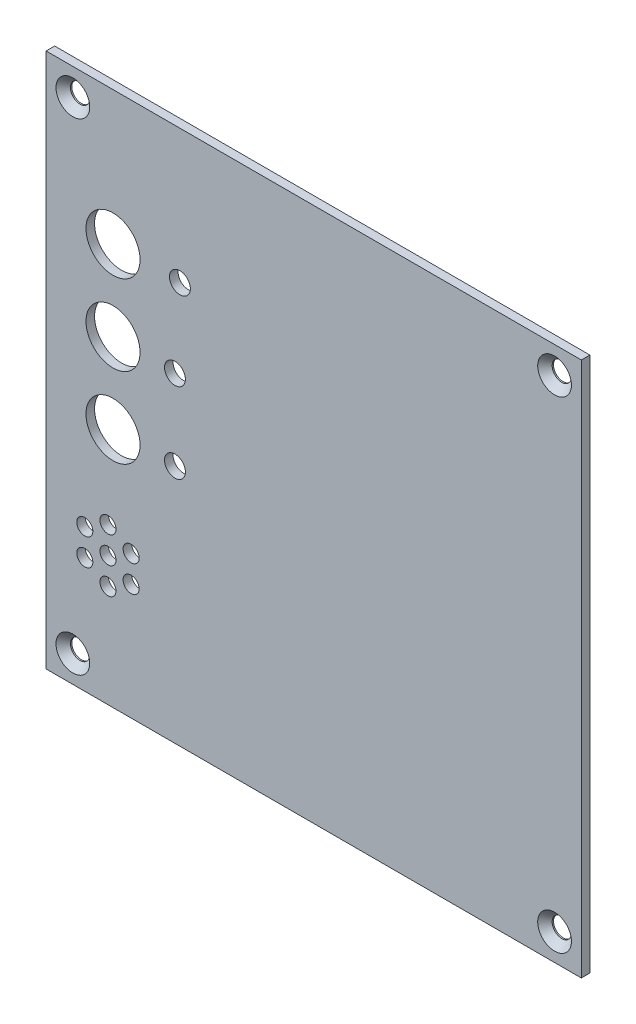
ISO-10303-21;
HEADER;
FILE_DESCRIPTION(('STEP AP214'),'2;1');
FILE_NAME('part.step','',(''),(''),'','','');
FILE_SCHEMA(('AUTOMOTIVE_DESIGN { 1 0 10303 214 1 1 1 1 }'));
ENDSEC;
DATA;
#1=APPLICATION_CONTEXT('core data for automotive mechanical design processes');
#2=APPLICATION_PROTOCOL_DEFINITION('international standard','automotive_design',2000,#1);
#3=PRODUCT_CONTEXT('',#1,'mechanical');
#4=PRODUCT('Part','Part','',(#3));
#5=PRODUCT_RELATED_PRODUCT_CATEGORY('part','',(#4));
#6=PRODUCT_DEFINITION_FORMATION('','',#4);
#7=PRODUCT_DEFINITION_CONTEXT('part definition',#1,'design');
#8=PRODUCT_DEFINITION('design','',#6,#7);
#9=PRODUCT_DEFINITION_SHAPE('','',#8);
#10=(LENGTH_UNIT() NAMED_UNIT(*) SI_UNIT(.MILLI.,.METRE.));
#11=(NAMED_UNIT(*) PLANE_ANGLE_UNIT() SI_UNIT($,.RADIAN.));
#12=(NAMED_UNIT(*) SI_UNIT($,.STERADIAN.) SOLID_ANGLE_UNIT());
#13=UNCERTAINTY_MEASURE_WITH_UNIT(LENGTH_MEASURE(1.E-05),#10,'distance_accuracy_value','');
#14=(GEOMETRIC_REPRESENTATION_CONTEXT(3) GLOBAL_UNCERTAINTY_ASSIGNED_CONTEXT((#13)) GLOBAL_UNIT_ASSIGNED_CONTEXT((#10,
#11,#12)) REPRESENTATION_CONTEXT('',''));
#15=CARTESIAN_POINT('',(0.,0.,0.));
#16=DIRECTION('',(0.,0.,1.));
#17=DIRECTION('',(1.,0.,0.));
#18=AXIS2_PLACEMENT_3D('',#15,#16,#17);
#19=CARTESIAN_POINT('',(0.,0.,0.));
#20=DIRECTION('',(0.,0.,-1.));
#21=DIRECTION('',(-1.,0.,0.));
#22=AXIS2_PLACEMENT_3D('',#19,#20,#21);
#23=PLANE('',#22);
#24=CARTESIAN_POINT('',(7.22687298107787,21.63,0.));
#25=DIRECTION('',(0.,0.,1.));
#26=DIRECTION('',(1.,0.,0.));
#27=AXIS2_PLACEMENT_3D('',#24,#25,#26);
#28=CIRCLE('',#27,1.5);
#29=CARTESIAN_POINT('',(8.72687298107787,21.63,0.));
#30=VERTEX_POINT('',#29);
#31=EDGE_CURVE('E181',#30,#30,#28,.T.);
#32=ORIENTED_EDGE('',*,*,#31,.T.);
#33=EDGE_LOOP('',(#32));
#34=FACE_BOUND('',#33,.T.);
#35=CARTESIAN_POINT('',(11.5570000000001,19.13,0.));
#36=DIRECTION('',(0.,0.,1.));
#37=DIRECTION('',(1.,0.,0.));
#38=AXIS2_PLACEMENT_3D('',#35,#36,#37);
#39=CIRCLE('',#38,1.5);
#40=CARTESIAN_POINT('',(13.0570000000001,19.13,0.));
#41=VERTEX_POINT('',#40);
#42=EDGE_CURVE('E188',#41,#41,#39,.T.);
#43=ORIENTED_EDGE('',*,*,#42,.T.);
#44=EDGE_LOOP('',(#43));
#45=FACE_BOUND('',#44,.T.);
#46=CARTESIAN_POINT('',(15.8871270189223,21.63,0.));
#47=DIRECTION('',(0.,0.,1.));
#48=DIRECTION('',(1.,0.,0.));
#49=AXIS2_PLACEMENT_3D('',#46,#47,#48);
#50=CIRCLE('',#49,1.5);
#51=CARTESIAN_POINT('',(17.3871270189223,21.63,0.));
#52=VERTEX_POINT('',#51);
#53=EDGE_CURVE('E194',#52,#52,#50,.T.);
#54=ORIENTED_EDGE('',*,*,#53,.T.);
#55=EDGE_LOOP('',(#54));
#56=FACE_BOUND('',#55,.T.);
#57=CARTESIAN_POINT('',(15.8871270189222,26.63,0.));
#58=DIRECTION('',(0.,0.,1.));
#59=DIRECTION('',(1.,0.,0.));
#60=AXIS2_PLACEMENT_3D('',#57,#58,#59);
#61=CIRCLE('',#60,1.5);
#62=CARTESIAN_POINT('',(17.3871270189222,26.63,0.));
#63=VERTEX_POINT('',#62);
#64=EDGE_CURVE('E170',#63,#63,#61,.T.);
#65=ORIENTED_EDGE('',*,*,#64,.T.);
#66=EDGE_LOOP('',(#65));
#67=FACE_BOUND('',#66,.T.);
#68=CARTESIAN_POINT('',(25.,75.,0.));
#69=DIRECTION('',(0.,0.,1.));
#70=DIRECTION('',(1.,0.,0.));
#71=AXIS2_PLACEMENT_3D('',#68,#69,#70);
#72=CIRCLE('',#71,1.94999999999999);
#73=CARTESIAN_POINT('',(26.95,75.,0.));
#74=VERTEX_POINT('',#73);
#75=EDGE_CURVE('E151',#74,#74,#72,.T.);
#76=ORIENTED_EDGE('',*,*,#75,.T.);
#77=EDGE_LOOP('',(#76));
#78=FACE_BOUND('',#77,.T.);
#79=CARTESIAN_POINT('',(11.557,24.13,0.));
#80=DIRECTION('',(0.,0.,1.));
#81=DIRECTION('',(1.,0.,0.));
#82=AXIS2_PLACEMENT_3D('',#79,#80,#81);
#83=CIRCLE('',#82,1.5);
#84=CARTESIAN_POINT('',(13.057,24.13,0.));
#85=VERTEX_POINT('',#84);
#86=EDGE_CURVE('E157',#85,#85,#83,.T.);
#87=ORIENTED_EDGE('',*,*,#86,.T.);
#88=EDGE_LOOP('',(#87));
#89=FACE_BOUND('',#88,.T.);
#90=CARTESIAN_POINT('',(12.5000000000002,60.,0.));
#91=DIRECTION('',(0.,0.,1.));
#92=DIRECTION('',(1.,0.,0.));
#93=AXIS2_PLACEMENT_3D('',#90,#91,#92);
#94=CIRCLE('',#93,5.05);
#95=CARTESIAN_POINT('',(17.5500000000002,60.,0.));
#96=VERTEX_POINT('',#95);
#97=EDGE_CURVE('E158',#96,#96,#94,.T.);
#98=ORIENTED_EDGE('',*,*,#97,.T.);
#99=EDGE_LOOP('',(#98));
#100=FACE_BOUND('',#99,.T.);
#101=CARTESIAN_POINT('',(11.557,29.13,0.));
#102=DIRECTION('',(0.,0.,1.));
#103=DIRECTION('',(1.,0.,0.));
#104=AXIS2_PLACEMENT_3D('',#101,#102,#103);
#105=CIRCLE('',#104,1.5);
#106=CARTESIAN_POINT('',(13.057,29.13,0.));
#107=VERTEX_POINT('',#106);
#108=EDGE_CURVE('E169',#107,#107,#105,.T.);
#109=ORIENTED_EDGE('',*,*,#108,.T.);
#110=EDGE_LOOP('',(#109));
#111=FACE_BOUND('',#110,.T.);
#112=CARTESIAN_POINT('',(7.22687298107785,26.63,0.));
#113=DIRECTION('',(0.,0.,1.));
#114=DIRECTION('',(1.,0.,0.));
#115=AXIS2_PLACEMENT_3D('',#112,#113,#114);
#116=CIRCLE('',#115,1.5);
#117=CARTESIAN_POINT('',(8.72687298107786,26.63,0.));
#118=VERTEX_POINT('',#117);
#119=EDGE_CURVE('E182',#118,#118,#116,.T.);
#120=ORIENTED_EDGE('',*,*,#119,.T.);
#121=EDGE_LOOP('',(#120));
#122=FACE_BOUND('',#121,.T.);
#123=CARTESIAN_POINT('',(12.5000000000003,45.,0.));
#124=DIRECTION('',(0.,0.,1.));
#125=DIRECTION('',(1.,0.,0.));
#126=AXIS2_PLACEMENT_3D('',#123,#124,#125);
#127=CIRCLE('',#126,5.05);
#128=CARTESIAN_POINT('',(17.5500000000003,45.,0.));
#129=VERTEX_POINT('',#128);
#130=EDGE_CURVE('E217',#129,#129,#127,.T.);
#131=ORIENTED_EDGE('',*,*,#130,.T.);
#132=EDGE_LOOP('',(#131));
#133=FACE_BOUND('',#132,.T.);
#134=CARTESIAN_POINT('',(24.0718017395184,59.8692460141133,0.));
#135=DIRECTION('',(0.,0.,1.));
#136=DIRECTION('',(1.,0.,0.));
#137=AXIS2_PLACEMENT_3D('',#134,#135,#136);
#138=CIRCLE('',#137,1.95);
#139=CARTESIAN_POINT('',(26.0218017395184,59.8692460141133,0.));
#140=VERTEX_POINT('',#139);
#141=EDGE_CURVE('E211',#140,#140,#138,.T.);
#142=ORIENTED_EDGE('',*,*,#141,.T.);
#143=EDGE_LOOP('',(#142));
#144=FACE_BOUND('',#143,.T.);
#145=CARTESIAN_POINT('',(24.0718017395186,44.8692460141133,0.));
#146=DIRECTION('',(0.,0.,1.));
#147=DIRECTION('',(1.,0.,0.));
#148=AXIS2_PLACEMENT_3D('',#145,#146,#147);
#149=CIRCLE('',#148,1.95);
#150=CARTESIAN_POINT('',(26.0218017395186,44.8692460141133,0.));
#151=VERTEX_POINT('',#150);
#152=EDGE_CURVE('E205',#151,#151,#149,.T.);
#153=ORIENTED_EDGE('',*,*,#152,.T.);
#154=EDGE_LOOP('',(#153));
#155=FACE_BOUND('',#154,.T.);
#156=CARTESIAN_POINT('',(12.5,75.,0.));
#157=DIRECTION('',(0.,0.,1.));
#158=DIRECTION('',(1.,0.,0.));
#159=AXIS2_PLACEMENT_3D('',#156,#157,#158);
#160=CIRCLE('',#159,5.05);
#161=CARTESIAN_POINT('',(17.55,75.,0.));
#162=VERTEX_POINT('',#161);
#163=EDGE_CURVE('E147',#162,#162,#160,.T.);
#164=ORIENTED_EDGE('',*,*,#163,.T.);
#165=EDGE_LOOP('',(#164));
#166=FACE_BOUND('',#165,.T.);
#167=CARTESIAN_POINT('',(4.99999999999999,95.,0.));
#168=DIRECTION('',(0.,0.,1.));
#169=DIRECTION('',(1.,0.,0.));
#170=AXIS2_PLACEMENT_3D('',#167,#168,#169);
#171=CIRCLE('',#170,1.8);
#172=CARTESIAN_POINT('',(6.79999999999999,95.,0.));
#173=VERTEX_POINT('',#172);
#174=EDGE_CURVE('E138',#173,#173,#171,.T.);
#175=ORIENTED_EDGE('',*,*,#174,.T.);
#176=EDGE_LOOP('',(#175));
#177=FACE_BOUND('',#176,.T.);
#178=CARTESIAN_POINT('',(95.,95.,0.));
#179=DIRECTION('',(0.,0.,1.));
#180=DIRECTION('',(1.,0.,0.));
#181=AXIS2_PLACEMENT_3D('',#178,#179,#180);
#182=CIRCLE('',#181,1.8);
#183=CARTESIAN_POINT('',(96.8,95.,0.));
#184=VERTEX_POINT('',#183);
#185=EDGE_CURVE('E129',#184,#184,#182,.T.);
#186=ORIENTED_EDGE('',*,*,#185,.T.);
#187=EDGE_LOOP('',(#186));
#188=FACE_BOUND('',#187,.T.);
#189=DIRECTION('',(0.,-1.,0.));
#190=VECTOR('',#189,1.);
#191=CARTESIAN_POINT('',(0.,0.,0.));
#192=LINE('',#191,#190);
#193=CARTESIAN_POINT('',(0.,100.,0.));
#194=VERTEX_POINT('',#193);
#195=CARTESIAN_POINT('',(0.,0.,0.));
#196=VERTEX_POINT('',#195);
#197=EDGE_CURVE('E98',#194,#196,#192,.T.);
#198=ORIENTED_EDGE('',*,*,#197,.F.);
#199=DIRECTION('',(-1.,0.,0.));
#200=VECTOR('',#199,1.);
#201=CARTESIAN_POINT('',(0.,100.,0.));
#202=LINE('',#201,#200);
#203=CARTESIAN_POINT('',(100.,100.,0.));
#204=VERTEX_POINT('',#203);
#205=EDGE_CURVE('E74',#204,#194,#202,.T.);
#206=ORIENTED_EDGE('',*,*,#205,.F.);
#207=DIRECTION('',(0.,1.,0.));
#208=VECTOR('',#207,1.);
#209=CARTESIAN_POINT('',(100.,0.,0.));
#210=LINE('',#209,#208);
#211=CARTESIAN_POINT('',(100.,0.,0.));
#212=VERTEX_POINT('',#211);
#213=EDGE_CURVE('E68',#212,#204,#210,.T.);
#214=ORIENTED_EDGE('',*,*,#213,.F.);
#215=DIRECTION('',(1.,0.,0.));
#216=VECTOR('',#215,1.);
#217=CARTESIAN_POINT('',(0.,0.,0.));
#218=LINE('',#217,#216);
#219=EDGE_CURVE('E90',#196,#212,#218,.T.);
#220=ORIENTED_EDGE('',*,*,#219,.F.);
#221=EDGE_LOOP('',(#198,#206,#214,#220));
#222=FACE_BOUND('',#221,.T.);
#223=CARTESIAN_POINT('',(4.99999999999999,5.,0.));
#224=DIRECTION('',(0.,0.,1.));
#225=DIRECTION('',(1.,0.,0.));
#226=AXIS2_PLACEMENT_3D('',#223,#224,#225);
#227=CIRCLE('',#226,1.8);
#228=CARTESIAN_POINT('',(6.79999999999999,5.,0.));
#229=VERTEX_POINT('',#228);
#230=EDGE_CURVE('E101',#229,#229,#227,.T.);
#231=ORIENTED_EDGE('',*,*,#230,.T.);
#232=EDGE_LOOP('',(#231));
#233=FACE_BOUND('',#232,.T.);
#234=CARTESIAN_POINT('',(95.,5.,0.));
#235=DIRECTION('',(0.,0.,1.));
#236=DIRECTION('',(1.,0.,0.));
#237=AXIS2_PLACEMENT_3D('',#234,#235,#236);
#238=CIRCLE('',#237,1.8);
#239=CARTESIAN_POINT('',(96.8,5.,0.));
#240=VERTEX_POINT('',#239);
#241=EDGE_CURVE('E120',#240,#240,#238,.T.);
#242=ORIENTED_EDGE('',*,*,#241,.T.);
#243=EDGE_LOOP('',(#242));
#244=FACE_BOUND('',#243,.T.);
#245=ADVANCED_FACE('F34',(#34,#45,#56,#67,#78,#89,#100,#111,#122,#133,#144,#155,#166,#177,#188,
#222,#233,#244),#23,.T.);
#246=CARTESIAN_POINT('',(0.,0.,1.6));
#247=DIRECTION('',(1.,0.,0.));
#248=DIRECTION('',(0.,1.,0.));
#249=AXIS2_PLACEMENT_3D('',#246,#247,#248);
#250=PLANE('',#249);
#251=ORIENTED_EDGE('',*,*,#197,.T.);
#252=DIRECTION('',(0.,0.,-1.));
#253=VECTOR('',#252,1.);
#254=CARTESIAN_POINT('',(0.,0.,1.6));
#255=LINE('',#254,#253);
#256=CARTESIAN_POINT('',(0.,0.,1.6));
#257=VERTEX_POINT('',#256);
#258=EDGE_CURVE('E11',#257,#196,#255,.T.);
#259=ORIENTED_EDGE('',*,*,#258,.F.);
#260=DIRECTION('',(0.,-1.,0.));
#261=VECTOR('',#260,1.);
#262=CARTESIAN_POINT('',(0.,0.,1.6));
#263=LINE('',#262,#261);
#264=CARTESIAN_POINT('',(0.,100.,1.6));
#265=VERTEX_POINT('',#264);
#266=EDGE_CURVE('E86',#265,#257,#263,.T.);
#267=ORIENTED_EDGE('',*,*,#266,.F.);
#268=DIRECTION('',(0.,0.,-1.));
#269=VECTOR('',#268,1.);
#270=CARTESIAN_POINT('',(0.,100.,1.6));
#271=LINE('',#270,#269);
#272=EDGE_CURVE('E94',#265,#194,#271,.T.);
#273=ORIENTED_EDGE('',*,*,#272,.T.);
#274=EDGE_LOOP('',(#251,#259,#267,#273));
#275=FACE_BOUND('',#274,.T.);
#276=ADVANCED_FACE('F36',(#275),#250,.F.);
#277=CARTESIAN_POINT('',(0.,0.,1.6));
#278=DIRECTION('',(0.,1.,0.));
#279=DIRECTION('',(0.,0.,1.));
#280=AXIS2_PLACEMENT_3D('',#277,#278,#279);
#281=PLANE('',#280);
#282=ORIENTED_EDGE('',*,*,#219,.T.);
#283=DIRECTION('',(0.,0.,-1.));
#284=VECTOR('',#283,1.);
#285=CARTESIAN_POINT('',(100.,0.,1.6));
#286=LINE('',#285,#284);
#287=CARTESIAN_POINT('',(100.,0.,1.6));
#288=VERTEX_POINT('',#287);
#289=EDGE_CURVE('E43',#288,#212,#286,.T.);
#290=ORIENTED_EDGE('',*,*,#289,.F.);
#291=DIRECTION('',(1.,0.,0.));
#292=VECTOR('',#291,1.);
#293=CARTESIAN_POINT('',(0.,0.,1.6));
#294=LINE('',#293,#292);
#295=EDGE_CURVE('E81',#257,#288,#294,.T.);
#296=ORIENTED_EDGE('',*,*,#295,.F.);
#297=ORIENTED_EDGE('',*,*,#258,.T.);
#298=EDGE_LOOP('',(#282,#290,#296,#297));
#299=FACE_BOUND('',#298,.T.);
#300=ADVANCED_FACE('F89',(#299),#281,.F.);
#301=CARTESIAN_POINT('',(100.,0.,1.6));
#302=DIRECTION('',(-1.,0.,0.));
#303=DIRECTION('',(0.,-1.,0.));
#304=AXIS2_PLACEMENT_3D('',#301,#302,#303);
#305=PLANE('',#304);
#306=ORIENTED_EDGE('',*,*,#213,.T.);
#307=DIRECTION('',(0.,0.,-1.));
#308=VECTOR('',#307,1.);
#309=CARTESIAN_POINT('',(100.,100.,1.6));
#310=LINE('',#309,#308);
#311=CARTESIAN_POINT('',(100.,100.,1.6));
#312=VERTEX_POINT('',#311);
#313=EDGE_CURVE('E91',#312,#204,#310,.T.);
#314=ORIENTED_EDGE('',*,*,#313,.F.);
#315=DIRECTION('',(0.,1.,0.));
#316=VECTOR('',#315,1.);
#317=CARTESIAN_POINT('',(100.,0.,1.6));
#318=LINE('',#317,#316);
#319=EDGE_CURVE('E84',#288,#312,#318,.T.);
#320=ORIENTED_EDGE('',*,*,#319,.F.);
#321=ORIENTED_EDGE('',*,*,#289,.T.);
#322=EDGE_LOOP('',(#306,#314,#320,#321));
#323=FACE_BOUND('',#322,.T.);
#324=ADVANCED_FACE('F92',(#323),#305,.F.);
#325=CARTESIAN_POINT('',(0.,100.,1.6));
#326=DIRECTION('',(0.,-1.,0.));
#327=DIRECTION('',(0.,0.,-1.));
#328=AXIS2_PLACEMENT_3D('',#325,#326,#327);
#329=PLANE('',#328);
#330=ORIENTED_EDGE('',*,*,#205,.T.);
#331=ORIENTED_EDGE('',*,*,#272,.F.);
#332=DIRECTION('',(-1.,0.,0.));
#333=VECTOR('',#332,1.);
#334=CARTESIAN_POINT('',(0.,100.,1.6));
#335=LINE('',#334,#333);
#336=EDGE_CURVE('E51',#312,#265,#335,.T.);
#337=ORIENTED_EDGE('',*,*,#336,.F.);
#338=ORIENTED_EDGE('',*,*,#313,.T.);
#339=EDGE_LOOP('',(#330,#331,#337,#338));
#340=FACE_BOUND('',#339,.T.);
#341=ADVANCED_FACE('F106',(#340),#329,.F.);
#342=CARTESIAN_POINT('',(0.,0.,1.6));
#343=DIRECTION('',(0.,0.,-1.));
#344=DIRECTION('',(-1.,0.,0.));
#345=AXIS2_PLACEMENT_3D('',#342,#343,#344);
#346=PLANE('',#345);
#347=CARTESIAN_POINT('',(7.22687298107787,21.63,1.6));
#348=DIRECTION('',(0.,0.,1.));
#349=DIRECTION('',(1.,0.,0.));
#350=AXIS2_PLACEMENT_3D('',#347,#348,#349);
#351=CIRCLE('',#350,1.5);
#352=CARTESIAN_POINT('',(8.72687298107787,21.63,1.6));
#353=VERTEX_POINT('',#352);
#354=EDGE_CURVE('E178',#353,#353,#351,.T.);
#355=ORIENTED_EDGE('',*,*,#354,.F.);
#356=EDGE_LOOP('',(#355));
#357=FACE_BOUND('',#356,.T.);
#358=CARTESIAN_POINT('',(11.5570000000001,19.13,1.6));
#359=DIRECTION('',(0.,0.,1.));
#360=DIRECTION('',(1.,0.,0.));
#361=AXIS2_PLACEMENT_3D('',#358,#359,#360);
#362=CIRCLE('',#361,1.5);
#363=CARTESIAN_POINT('',(13.0570000000001,19.13,1.6));
#364=VERTEX_POINT('',#363);
#365=EDGE_CURVE('E185',#364,#364,#362,.T.);
#366=ORIENTED_EDGE('',*,*,#365,.F.);
#367=EDGE_LOOP('',(#366));
#368=FACE_BOUND('',#367,.T.);
#369=CARTESIAN_POINT('',(15.8871270189223,21.63,1.6));
#370=DIRECTION('',(0.,0.,1.));
#371=DIRECTION('',(1.,0.,0.));
#372=AXIS2_PLACEMENT_3D('',#369,#370,#371);
#373=CIRCLE('',#372,1.5);
#374=CARTESIAN_POINT('',(17.3871270189223,21.63,1.6));
#375=VERTEX_POINT('',#374);
#376=EDGE_CURVE('E191',#375,#375,#373,.T.);
#377=ORIENTED_EDGE('',*,*,#376,.F.);
#378=EDGE_LOOP('',(#377));
#379=FACE_BOUND('',#378,.T.);
#380=CARTESIAN_POINT('',(15.8871270189222,26.63,1.6));
#381=DIRECTION('',(0.,0.,1.));
#382=DIRECTION('',(1.,0.,0.));
#383=AXIS2_PLACEMENT_3D('',#380,#381,#382);
#384=CIRCLE('',#383,1.5);
#385=CARTESIAN_POINT('',(17.3871270189222,26.63,1.6));
#386=VERTEX_POINT('',#385);
#387=EDGE_CURVE('E197',#386,#386,#384,.T.);
#388=ORIENTED_EDGE('',*,*,#387,.F.);
#389=EDGE_LOOP('',(#388));
#390=FACE_BOUND('',#389,.T.);
#391=CARTESIAN_POINT('',(25.,75.,1.6));
#392=DIRECTION('',(0.,0.,1.));
#393=DIRECTION('',(1.,0.,0.));
#394=AXIS2_PLACEMENT_3D('',#391,#392,#393);
#395=CIRCLE('',#394,1.94999999999999);
#396=CARTESIAN_POINT('',(26.95,75.,1.6));
#397=VERTEX_POINT('',#396);
#398=EDGE_CURVE('E161',#397,#397,#395,.T.);
#399=ORIENTED_EDGE('',*,*,#398,.F.);
#400=EDGE_LOOP('',(#399));
#401=FACE_BOUND('',#400,.T.);
#402=CARTESIAN_POINT('',(11.557,24.13,1.6));
#403=DIRECTION('',(0.,0.,1.));
#404=DIRECTION('',(1.,0.,0.));
#405=AXIS2_PLACEMENT_3D('',#402,#403,#404);
#406=CIRCLE('',#405,1.5);
#407=CARTESIAN_POINT('',(13.057,24.13,1.6));
#408=VERTEX_POINT('',#407);
#409=EDGE_CURVE('E154',#408,#408,#406,.T.);
#410=ORIENTED_EDGE('',*,*,#409,.F.);
#411=EDGE_LOOP('',(#410));
#412=FACE_BOUND('',#411,.T.);
#413=CARTESIAN_POINT('',(12.5000000000002,60.,1.6));
#414=DIRECTION('',(0.,0.,1.));
#415=DIRECTION('',(1.,0.,0.));
#416=AXIS2_PLACEMENT_3D('',#413,#414,#415);
#417=CIRCLE('',#416,5.05);
#418=CARTESIAN_POINT('',(17.5500000000002,60.,1.6));
#419=VERTEX_POINT('',#418);
#420=EDGE_CURVE('E173',#419,#419,#417,.T.);
#421=ORIENTED_EDGE('',*,*,#420,.F.);
#422=EDGE_LOOP('',(#421));
#423=FACE_BOUND('',#422,.T.);
#424=CARTESIAN_POINT('',(11.557,29.13,1.6));
#425=DIRECTION('',(0.,0.,1.));
#426=DIRECTION('',(1.,0.,0.));
#427=AXIS2_PLACEMENT_3D('',#424,#425,#426);
#428=CIRCLE('',#427,1.5);
#429=CARTESIAN_POINT('',(13.057,29.13,1.6));
#430=VERTEX_POINT('',#429);
#431=EDGE_CURVE('E166',#430,#430,#428,.T.);
#432=ORIENTED_EDGE('',*,*,#431,.F.);
#433=EDGE_LOOP('',(#432));
#434=FACE_BOUND('',#433,.T.);
#435=CARTESIAN_POINT('',(7.22687298107785,26.63,1.6));
#436=DIRECTION('',(0.,0.,1.));
#437=DIRECTION('',(1.,0.,0.));
#438=AXIS2_PLACEMENT_3D('',#435,#436,#437);
#439=CIRCLE('',#438,1.5);
#440=CARTESIAN_POINT('',(8.72687298107786,26.63,1.6));
#441=VERTEX_POINT('',#440);
#442=EDGE_CURVE('E220',#441,#441,#439,.T.);
#443=ORIENTED_EDGE('',*,*,#442,.F.);
#444=EDGE_LOOP('',(#443));
#445=FACE_BOUND('',#444,.T.);
#446=CARTESIAN_POINT('',(12.5000000000003,45.,1.6));
#447=DIRECTION('',(0.,0.,1.));
#448=DIRECTION('',(1.,0.,0.));
#449=AXIS2_PLACEMENT_3D('',#446,#447,#448);
#450=CIRCLE('',#449,5.05);
#451=CARTESIAN_POINT('',(17.5500000000003,45.,1.6));
#452=VERTEX_POINT('',#451);
#453=EDGE_CURVE('E214',#452,#452,#450,.T.);
#454=ORIENTED_EDGE('',*,*,#453,.F.);
#455=EDGE_LOOP('',(#454));
#456=FACE_BOUND('',#455,.T.);
#457=CARTESIAN_POINT('',(24.0718017395184,59.8692460141133,1.6));
#458=DIRECTION('',(0.,0.,1.));
#459=DIRECTION('',(1.,0.,0.));
#460=AXIS2_PLACEMENT_3D('',#457,#458,#459);
#461=CIRCLE('',#460,1.95);
#462=CARTESIAN_POINT('',(26.0218017395184,59.8692460141133,1.6));
#463=VERTEX_POINT('',#462);
#464=EDGE_CURVE('E208',#463,#463,#461,.T.);
#465=ORIENTED_EDGE('',*,*,#464,.F.);
#466=EDGE_LOOP('',(#465));
#467=FACE_BOUND('',#466,.T.);
#468=CARTESIAN_POINT('',(24.0718017395186,44.8692460141133,1.6));
#469=DIRECTION('',(0.,0.,1.));
#470=DIRECTION('',(1.,0.,0.));
#471=AXIS2_PLACEMENT_3D('',#468,#469,#470);
#472=CIRCLE('',#471,1.95);
#473=CARTESIAN_POINT('',(26.0218017395186,44.8692460141133,1.6));
#474=VERTEX_POINT('',#473);
#475=EDGE_CURVE('E202',#474,#474,#472,.T.);
#476=ORIENTED_EDGE('',*,*,#475,.F.);
#477=EDGE_LOOP('',(#476));
#478=FACE_BOUND('',#477,.T.);
#479=CARTESIAN_POINT('',(12.5,75.,1.6));
#480=DIRECTION('',(0.,0.,1.));
#481=DIRECTION('',(1.,0.,0.));
#482=AXIS2_PLACEMENT_3D('',#479,#480,#481);
#483=CIRCLE('',#482,5.05);
#484=CARTESIAN_POINT('',(17.55,75.,1.6));
#485=VERTEX_POINT('',#484);
#486=EDGE_CURVE('E148',#485,#485,#483,.T.);
#487=ORIENTED_EDGE('',*,*,#486,.F.);
#488=EDGE_LOOP('',(#487));
#489=FACE_BOUND('',#488,.T.);
#490=CARTESIAN_POINT('',(4.99999999999999,95.,1.6));
#491=DIRECTION('',(0.,0.,1.));
#492=DIRECTION('',(1.,0.,0.));
#493=AXIS2_PLACEMENT_3D('',#490,#491,#492);
#494=CIRCLE('',#493,3.15);
#495=CARTESIAN_POINT('',(8.14999999999999,95.,1.6));
#496=VERTEX_POINT('',#495);
#497=EDGE_CURVE('E144',#496,#496,#494,.T.);
#498=ORIENTED_EDGE('',*,*,#497,.F.);
#499=EDGE_LOOP('',(#498));
#500=FACE_BOUND('',#499,.T.);
#501=CARTESIAN_POINT('',(95.,95.,1.6));
#502=DIRECTION('',(0.,0.,1.));
#503=DIRECTION('',(1.,0.,0.));
#504=AXIS2_PLACEMENT_3D('',#501,#502,#503);
#505=CIRCLE('',#504,3.15);
#506=CARTESIAN_POINT('',(98.15,95.,1.6));
#507=VERTEX_POINT('',#506);
#508=EDGE_CURVE('E135',#507,#507,#505,.T.);
#509=ORIENTED_EDGE('',*,*,#508,.F.);
#510=EDGE_LOOP('',(#509));
#511=FACE_BOUND('',#510,.T.);
#512=CARTESIAN_POINT('',(95.,5.,1.6));
#513=DIRECTION('',(0.,0.,1.));
#514=DIRECTION('',(1.,0.,0.));
#515=AXIS2_PLACEMENT_3D('',#512,#513,#514);
#516=CIRCLE('',#515,3.15);
#517=CARTESIAN_POINT('',(98.15,5.,1.6));
#518=VERTEX_POINT('',#517);
#519=EDGE_CURVE('E126',#518,#518,#516,.T.);
#520=ORIENTED_EDGE('',*,*,#519,.F.);
#521=EDGE_LOOP('',(#520));
#522=FACE_BOUND('',#521,.T.);
#523=CARTESIAN_POINT('',(4.99999999999999,5.,1.6));
#524=DIRECTION('',(0.,0.,1.));
#525=DIRECTION('',(1.,0.,0.));
#526=AXIS2_PLACEMENT_3D('',#523,#524,#525);
#527=CIRCLE('',#526,3.15);
#528=CARTESIAN_POINT('',(8.14999999999999,5.,1.6));
#529=VERTEX_POINT('',#528);
#530=EDGE_CURVE('E117',#529,#529,#527,.T.);
#531=ORIENTED_EDGE('',*,*,#530,.F.);
#532=EDGE_LOOP('',(#531));
#533=FACE_BOUND('',#532,.T.);
#534=ORIENTED_EDGE('',*,*,#266,.T.);
#535=ORIENTED_EDGE('',*,*,#295,.T.);
#536=ORIENTED_EDGE('',*,*,#319,.T.);
#537=ORIENTED_EDGE('',*,*,#336,.T.);
#538=EDGE_LOOP('',(#534,#535,#536,#537));
#539=FACE_BOUND('',#538,.T.);
#540=ADVANCED_FACE('F82',(#357,#368,#379,#390,#401,#412,#423,#434,#445,#456,#467,#478,#489,#500,
#511,#522,#533,#539),#346,.F.);
#541=CARTESIAN_POINT('',(4.99999999999999,5.,1.6));
#542=DIRECTION('',(0.,0.,1.));
#543=DIRECTION('',(1.,0.,0.));
#544=AXIS2_PLACEMENT_3D('',#541,#542,#543);
#545=CYLINDRICAL_SURFACE('',#544,1.8);
#546=ORIENTED_EDGE('',*,*,#230,.F.);
#547=EDGE_LOOP('',(#546));
#548=FACE_BOUND('',#547,.T.);
#549=CARTESIAN_POINT('',(4.99999999999999,5.,0.25));
#550=DIRECTION('',(0.,0.,1.));
#551=DIRECTION('',(1.,0.,0.));
#552=AXIS2_PLACEMENT_3D('',#549,#550,#551);
#553=CIRCLE('',#552,1.8);
#554=CARTESIAN_POINT('',(6.79999999999999,5.,0.25));
#555=VERTEX_POINT('',#554);
#556=EDGE_CURVE('E114',#555,#555,#553,.T.);
#557=ORIENTED_EDGE('',*,*,#556,.T.);
#558=EDGE_LOOP('',(#557));
#559=FACE_BOUND('',#558,.T.);
#560=ADVANCED_FACE('F238',(#548,#559),#545,.F.);
#561=CARTESIAN_POINT('',(4.99999999999999,5.,1.6));
#562=DIRECTION('',(0.,0.,1.));
#563=DIRECTION('',(1.,0.,0.));
#564=AXIS2_PLACEMENT_3D('',#561,#562,#563);
#565=CONICAL_SURFACE('',#564,3.15,0.785398163397449);
#566=ORIENTED_EDGE('',*,*,#556,.F.);
#567=EDGE_LOOP('',(#566));
#568=FACE_BOUND('',#567,.T.);
#569=ORIENTED_EDGE('',*,*,#530,.T.);
#570=EDGE_LOOP('',(#569));
#571=FACE_BOUND('',#570,.T.);
#572=ADVANCED_FACE('F257',(#568,#571),#565,.F.);
#573=CARTESIAN_POINT('',(95.,5.,1.6));
#574=DIRECTION('',(0.,0.,1.));
#575=DIRECTION('',(1.,0.,0.));
#576=AXIS2_PLACEMENT_3D('',#573,#574,#575);
#577=CYLINDRICAL_SURFACE('',#576,1.8);
#578=ORIENTED_EDGE('',*,*,#241,.F.);
#579=EDGE_LOOP('',(#578));
#580=FACE_BOUND('',#579,.T.);
#581=CARTESIAN_POINT('',(95.,5.,0.25));
#582=DIRECTION('',(0.,0.,1.));
#583=DIRECTION('',(1.,0.,0.));
#584=AXIS2_PLACEMENT_3D('',#581,#582,#583);
#585=CIRCLE('',#584,1.8);
#586=CARTESIAN_POINT('',(96.8,5.,0.25));
#587=VERTEX_POINT('',#586);
#588=EDGE_CURVE('E123',#587,#587,#585,.T.);
#589=ORIENTED_EDGE('',*,*,#588,.T.);
#590=EDGE_LOOP('',(#589));
#591=FACE_BOUND('',#590,.T.);
#592=ADVANCED_FACE('F259',(#580,#591),#577,.F.);
#593=CARTESIAN_POINT('',(95.,5.,1.6));
#594=DIRECTION('',(0.,0.,1.));
#595=DIRECTION('',(1.,0.,0.));
#596=AXIS2_PLACEMENT_3D('',#593,#594,#595);
#597=CONICAL_SURFACE('',#596,3.15,0.78539816339745);
#598=ORIENTED_EDGE('',*,*,#588,.F.);
#599=EDGE_LOOP('',(#598));
#600=FACE_BOUND('',#599,.T.);
#601=ORIENTED_EDGE('',*,*,#519,.T.);
#602=EDGE_LOOP('',(#601));
#603=FACE_BOUND('',#602,.T.);
#604=ADVANCED_FACE('F266',(#600,#603),#597,.F.);
#605=CARTESIAN_POINT('',(95.,95.,1.6));
#606=DIRECTION('',(0.,0.,1.));
#607=DIRECTION('',(1.,0.,0.));
#608=AXIS2_PLACEMENT_3D('',#605,#606,#607);
#609=CYLINDRICAL_SURFACE('',#608,1.8);
#610=ORIENTED_EDGE('',*,*,#185,.F.);
#611=EDGE_LOOP('',(#610));
#612=FACE_BOUND('',#611,.T.);
#613=CARTESIAN_POINT('',(95.,95.,0.25));
#614=DIRECTION('',(0.,0.,1.));
#615=DIRECTION('',(1.,0.,0.));
#616=AXIS2_PLACEMENT_3D('',#613,#614,#615);
#617=CIRCLE('',#616,1.8);
#618=CARTESIAN_POINT('',(96.8,95.,0.25));
#619=VERTEX_POINT('',#618);
#620=EDGE_CURVE('E132',#619,#619,#617,.T.);
#621=ORIENTED_EDGE('',*,*,#620,.T.);
#622=EDGE_LOOP('',(#621));
#623=FACE_BOUND('',#622,.T.);
#624=ADVANCED_FACE('F325',(#612,#623),#609,.F.);
#625=CARTESIAN_POINT('',(95.,95.,1.6));
#626=DIRECTION('',(0.,0.,1.));
#627=DIRECTION('',(1.,0.,0.));
#628=AXIS2_PLACEMENT_3D('',#625,#626,#627);
#629=CONICAL_SURFACE('',#628,3.15,0.78539816339745);
#630=ORIENTED_EDGE('',*,*,#620,.F.);
#631=EDGE_LOOP('',(#630));
#632=FACE_BOUND('',#631,.T.);
#633=ORIENTED_EDGE('',*,*,#508,.T.);
#634=EDGE_LOOP('',(#633));
#635=FACE_BOUND('',#634,.T.);
#636=ADVANCED_FACE('F335',(#632,#635),#629,.F.);
#637=CARTESIAN_POINT('',(4.99999999999999,95.,1.6));
#638=DIRECTION('',(0.,0.,1.));
#639=DIRECTION('',(1.,0.,0.));
#640=AXIS2_PLACEMENT_3D('',#637,#638,#639);
#641=CYLINDRICAL_SURFACE('',#640,1.8);
#642=ORIENTED_EDGE('',*,*,#174,.F.);
#643=EDGE_LOOP('',(#642));
#644=FACE_BOUND('',#643,.T.);
#645=CARTESIAN_POINT('',(4.99999999999999,95.,0.25));
#646=DIRECTION('',(0.,0.,1.));
#647=DIRECTION('',(1.,0.,0.));
#648=AXIS2_PLACEMENT_3D('',#645,#646,#647);
#649=CIRCLE('',#648,1.8);
#650=CARTESIAN_POINT('',(6.79999999999999,95.,0.25));
#651=VERTEX_POINT('',#650);
#652=EDGE_CURVE('E141',#651,#651,#649,.T.);
#653=ORIENTED_EDGE('',*,*,#652,.T.);
#654=EDGE_LOOP('',(#653));
#655=FACE_BOUND('',#654,.T.);
#656=ADVANCED_FACE('F345',(#644,#655),#641,.F.);
#657=CARTESIAN_POINT('',(4.99999999999999,95.,1.6));
#658=DIRECTION('',(0.,0.,1.));
#659=DIRECTION('',(1.,0.,0.));
#660=AXIS2_PLACEMENT_3D('',#657,#658,#659);
#661=CONICAL_SURFACE('',#660,3.15,0.785398163397449);
#662=ORIENTED_EDGE('',*,*,#652,.F.);
#663=EDGE_LOOP('',(#662));
#664=FACE_BOUND('',#663,.T.);
#665=ORIENTED_EDGE('',*,*,#497,.T.);
#666=EDGE_LOOP('',(#665));
#667=FACE_BOUND('',#666,.T.);
#668=ADVANCED_FACE('F355',(#664,#667),#661,.F.);
#669=CARTESIAN_POINT('',(12.5,75.,0.));
#670=DIRECTION('',(0.,0.,1.));
#671=DIRECTION('',(1.,0.,0.));
#672=AXIS2_PLACEMENT_3D('',#669,#670,#671);
#673=CYLINDRICAL_SURFACE('',#672,5.05);
#674=ORIENTED_EDGE('',*,*,#163,.F.);
#675=EDGE_LOOP('',(#674));
#676=FACE_BOUND('',#675,.T.);
#677=ORIENTED_EDGE('',*,*,#486,.T.);
#678=EDGE_LOOP('',(#677));
#679=FACE_BOUND('',#678,.T.);
#680=ADVANCED_FACE('F364',(#676,#679),#673,.F.);
#681=CARTESIAN_POINT('',(24.0718017395186,44.8692460141133,0.));
#682=DIRECTION('',(0.,0.,1.));
#683=DIRECTION('',(1.,0.,0.));
#684=AXIS2_PLACEMENT_3D('',#681,#682,#683);
#685=CYLINDRICAL_SURFACE('',#684,1.95);
#686=ORIENTED_EDGE('',*,*,#152,.F.);
#687=EDGE_LOOP('',(#686));
#688=FACE_BOUND('',#687,.T.);
#689=ORIENTED_EDGE('',*,*,#475,.T.);
#690=EDGE_LOOP('',(#689));
#691=FACE_BOUND('',#690,.T.);
#692=ADVANCED_FACE('F389',(#688,#691),#685,.F.);
#693=CARTESIAN_POINT('',(24.0718017395184,59.8692460141133,0.));
#694=DIRECTION('',(0.,0.,1.));
#695=DIRECTION('',(1.,0.,0.));
#696=AXIS2_PLACEMENT_3D('',#693,#694,#695);
#697=CYLINDRICAL_SURFACE('',#696,1.95);
#698=ORIENTED_EDGE('',*,*,#141,.F.);
#699=EDGE_LOOP('',(#698));
#700=FACE_BOUND('',#699,.T.);
#701=ORIENTED_EDGE('',*,*,#464,.T.);
#702=EDGE_LOOP('',(#701));
#703=FACE_BOUND('',#702,.T.);
#704=ADVANCED_FACE('F396',(#700,#703),#697,.F.);
#705=CARTESIAN_POINT('',(12.5000000000003,45.,0.));
#706=DIRECTION('',(0.,0.,1.));
#707=DIRECTION('',(1.,0.,0.));
#708=AXIS2_PLACEMENT_3D('',#705,#706,#707);
#709=CYLINDRICAL_SURFACE('',#708,5.05);
#710=ORIENTED_EDGE('',*,*,#130,.F.);
#711=EDGE_LOOP('',(#710));
#712=FACE_BOUND('',#711,.T.);
#713=ORIENTED_EDGE('',*,*,#453,.T.);
#714=EDGE_LOOP('',(#713));
#715=FACE_BOUND('',#714,.T.);
#716=ADVANCED_FACE('F232',(#712,#715),#709,.F.);
#717=CARTESIAN_POINT('',(7.22687298107785,26.63,0.));
#718=DIRECTION('',(0.,0.,1.));
#719=DIRECTION('',(1.,0.,0.));
#720=AXIS2_PLACEMENT_3D('',#717,#718,#719);
#721=CYLINDRICAL_SURFACE('',#720,1.5);
#722=ORIENTED_EDGE('',*,*,#119,.F.);
#723=EDGE_LOOP('',(#722));
#724=FACE_BOUND('',#723,.T.);
#725=ORIENTED_EDGE('',*,*,#442,.T.);
#726=EDGE_LOOP('',(#725));
#727=FACE_BOUND('',#726,.T.);
#728=ADVANCED_FACE('F228',(#724,#727),#721,.F.);
#729=CARTESIAN_POINT('',(11.557,29.13,0.));
#730=DIRECTION('',(0.,0.,1.));
#731=DIRECTION('',(1.,0.,0.));
#732=AXIS2_PLACEMENT_3D('',#729,#730,#731);
#733=CYLINDRICAL_SURFACE('',#732,1.5);
#734=ORIENTED_EDGE('',*,*,#108,.F.);
#735=EDGE_LOOP('',(#734));
#736=FACE_BOUND('',#735,.T.);
#737=ORIENTED_EDGE('',*,*,#431,.T.);
#738=EDGE_LOOP('',(#737));
#739=FACE_BOUND('',#738,.T.);
#740=ADVANCED_FACE('F231',(#736,#739),#733,.F.);
#741=CARTESIAN_POINT('',(12.5000000000002,60.,0.));
#742=DIRECTION('',(0.,0.,1.));
#743=DIRECTION('',(1.,0.,0.));
#744=AXIS2_PLACEMENT_3D('',#741,#742,#743);
#745=CYLINDRICAL_SURFACE('',#744,5.05);
#746=ORIENTED_EDGE('',*,*,#97,.F.);
#747=EDGE_LOOP('',(#746));
#748=FACE_BOUND('',#747,.T.);
#749=ORIENTED_EDGE('',*,*,#420,.T.);
#750=EDGE_LOOP('',(#749));
#751=FACE_BOUND('',#750,.T.);
#752=ADVANCED_FACE('F422',(#748,#751),#745,.F.);
#753=CARTESIAN_POINT('',(11.557,24.13,0.));
#754=DIRECTION('',(0.,0.,1.));
#755=DIRECTION('',(1.,0.,0.));
#756=AXIS2_PLACEMENT_3D('',#753,#754,#755);
#757=CYLINDRICAL_SURFACE('',#756,1.5);
#758=ORIENTED_EDGE('',*,*,#86,.F.);
#759=EDGE_LOOP('',(#758));
#760=FACE_BOUND('',#759,.T.);
#761=ORIENTED_EDGE('',*,*,#409,.T.);
#762=EDGE_LOOP('',(#761));
#763=FACE_BOUND('',#762,.T.);
#764=ADVANCED_FACE('F430',(#760,#763),#757,.F.);
#765=CARTESIAN_POINT('',(25.,75.,0.));
#766=DIRECTION('',(0.,0.,1.));
#767=DIRECTION('',(1.,0.,0.));
#768=AXIS2_PLACEMENT_3D('',#765,#766,#767);
#769=CYLINDRICAL_SURFACE('',#768,1.94999999999999);
#770=ORIENTED_EDGE('',*,*,#75,.F.);
#771=EDGE_LOOP('',(#770));
#772=FACE_BOUND('',#771,.T.);
#773=ORIENTED_EDGE('',*,*,#398,.T.);
#774=EDGE_LOOP('',(#773));
#775=FACE_BOUND('',#774,.T.);
#776=ADVANCED_FACE('F438',(#772,#775),#769,.F.);
#777=CARTESIAN_POINT('',(15.8871270189222,26.63,0.));
#778=DIRECTION('',(0.,0.,1.));
#779=DIRECTION('',(1.,0.,0.));
#780=AXIS2_PLACEMENT_3D('',#777,#778,#779);
#781=CYLINDRICAL_SURFACE('',#780,1.5);
#782=ORIENTED_EDGE('',*,*,#64,.F.);
#783=EDGE_LOOP('',(#782));
#784=FACE_BOUND('',#783,.T.);
#785=ORIENTED_EDGE('',*,*,#387,.T.);
#786=EDGE_LOOP('',(#785));
#787=FACE_BOUND('',#786,.T.);
#788=ADVANCED_FACE('F446',(#784,#787),#781,.F.);
#789=CARTESIAN_POINT('',(15.8871270189223,21.63,0.));
#790=DIRECTION('',(0.,0.,1.));
#791=DIRECTION('',(1.,0.,0.));
#792=AXIS2_PLACEMENT_3D('',#789,#790,#791);
#793=CYLINDRICAL_SURFACE('',#792,1.5);
#794=ORIENTED_EDGE('',*,*,#53,.F.);
#795=EDGE_LOOP('',(#794));
#796=FACE_BOUND('',#795,.T.);
#797=ORIENTED_EDGE('',*,*,#376,.T.);
#798=EDGE_LOOP('',(#797));
#799=FACE_BOUND('',#798,.T.);
#800=ADVANCED_FACE('F454',(#796,#799),#793,.F.);
#801=CARTESIAN_POINT('',(11.5570000000001,19.13,0.));
#802=DIRECTION('',(0.,0.,1.));
#803=DIRECTION('',(1.,0.,0.));
#804=AXIS2_PLACEMENT_3D('',#801,#802,#803);
#805=CYLINDRICAL_SURFACE('',#804,1.5);
#806=ORIENTED_EDGE('',*,*,#42,.F.);
#807=EDGE_LOOP('',(#806));
#808=FACE_BOUND('',#807,.T.);
#809=ORIENTED_EDGE('',*,*,#365,.T.);
#810=EDGE_LOOP('',(#809));
#811=FACE_BOUND('',#810,.T.);
#812=ADVANCED_FACE('F462',(#808,#811),#805,.F.);
#813=CARTESIAN_POINT('',(7.22687298107787,21.63,0.));
#814=DIRECTION('',(0.,0.,1.));
#815=DIRECTION('',(1.,0.,0.));
#816=AXIS2_PLACEMENT_3D('',#813,#814,#815);
#817=CYLINDRICAL_SURFACE('',#816,1.5);
#818=ORIENTED_EDGE('',*,*,#31,.F.);
#819=EDGE_LOOP('',(#818));
#820=FACE_BOUND('',#819,.T.);
#821=ORIENTED_EDGE('',*,*,#354,.T.);
#822=EDGE_LOOP('',(#821));
#823=FACE_BOUND('',#822,.T.);
#824=ADVANCED_FACE('F470',(#820,#823),#817,.F.);
#825=CLOSED_SHELL('',(#245,#276,#300,#324,#341,#540,#560,#572,#592,#604,#624,#636,#656,#668,
#680,#692,#704,#716,#728,#740,#752,#764,#776,#788,#800,#812,#824));
#826=MANIFOLD_SOLID_BREP('B2',#825);
#827=ADVANCED_BREP_SHAPE_REPRESENTATION('',(#18,#826),#14);
#828=SHAPE_DEFINITION_REPRESENTATION(#9,#827);
ENDSEC;
END-ISO-10303-21;
